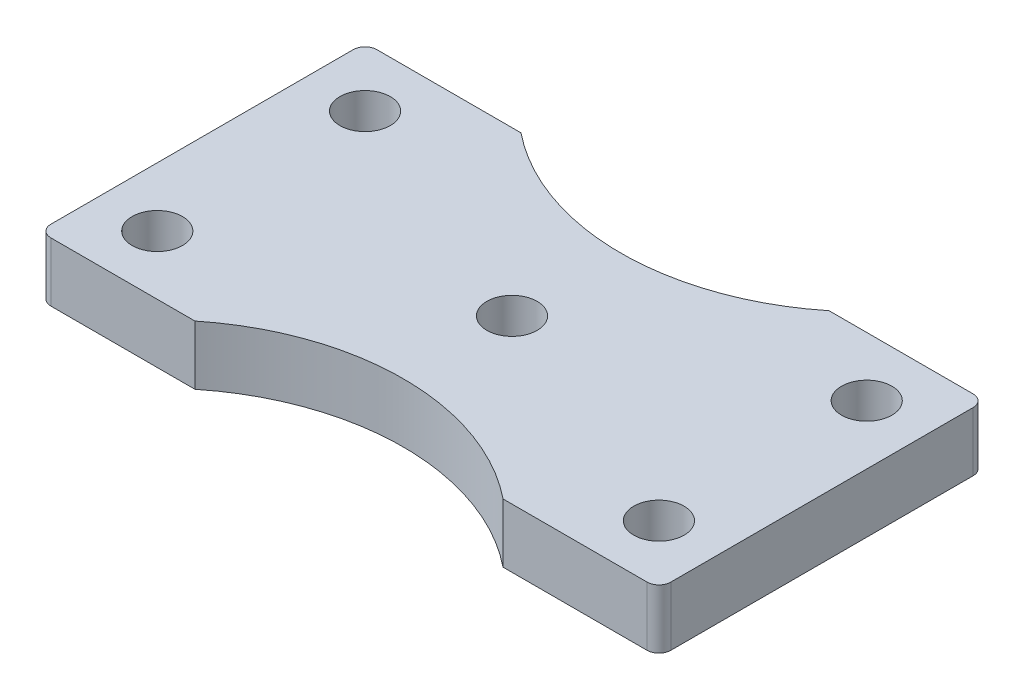
ISO-10303-21;
HEADER;
FILE_DESCRIPTION(('STEP AP214'),'2;1');
FILE_NAME('part.step','',(''),(''),'','','');
FILE_SCHEMA(('AUTOMOTIVE_DESIGN { 1 0 10303 214 1 1 1 1 }'));
ENDSEC;
DATA;
#1=APPLICATION_CONTEXT('core data for automotive mechanical design processes');
#2=APPLICATION_PROTOCOL_DEFINITION('international standard','automotive_design',2000,#1);
#3=PRODUCT_CONTEXT('',#1,'mechanical');
#4=PRODUCT('Part','Part','',(#3));
#5=PRODUCT_RELATED_PRODUCT_CATEGORY('part','',(#4));
#6=PRODUCT_DEFINITION_FORMATION('','',#4);
#7=PRODUCT_DEFINITION_CONTEXT('part definition',#1,'design');
#8=PRODUCT_DEFINITION('design','',#6,#7);
#9=PRODUCT_DEFINITION_SHAPE('','',#8);
#10=(LENGTH_UNIT() NAMED_UNIT(*) SI_UNIT(.MILLI.,.METRE.));
#11=(NAMED_UNIT(*) PLANE_ANGLE_UNIT() SI_UNIT($,.RADIAN.));
#12=(NAMED_UNIT(*) SI_UNIT($,.STERADIAN.) SOLID_ANGLE_UNIT());
#13=UNCERTAINTY_MEASURE_WITH_UNIT(LENGTH_MEASURE(1.E-05),#10,'distance_accuracy_value','');
#14=(GEOMETRIC_REPRESENTATION_CONTEXT(3) GLOBAL_UNCERTAINTY_ASSIGNED_CONTEXT((#13)) GLOBAL_UNIT_ASSIGNED_CONTEXT((#10,
#11,#12)) REPRESENTATION_CONTEXT('',''));
#15=CARTESIAN_POINT('',(0.,0.,0.));
#16=DIRECTION('',(0.,0.,1.));
#17=DIRECTION('',(1.,0.,0.));
#18=AXIS2_PLACEMENT_3D('',#15,#16,#17);
#19=CARTESIAN_POINT('',(16.01089,3.175,-8.11911));
#20=DIRECTION('',(0.,-1.,0.));
#21=DIRECTION('',(0.,0.,-1.));
#22=AXIS2_PLACEMENT_3D('',#19,#20,#21);
#23=CYLINDRICAL_SURFACE('',#22,0.635);
#24=CARTESIAN_POINT('',(16.01089,0.,-8.11911));
#25=DIRECTION('',(0.,-1.,0.));
#26=DIRECTION('',(0.,0.,-1.));
#27=AXIS2_PLACEMENT_3D('',#24,#25,#26);
#28=CIRCLE('',#27,0.635);
#29=CARTESIAN_POINT('',(16.01089,0.,-8.75411));
#30=VERTEX_POINT('',#29);
#31=CARTESIAN_POINT('',(16.64589,0.,-8.11911));
#32=VERTEX_POINT('',#31);
#33=EDGE_CURVE('E119',#30,#32,#28,.T.);
#34=ORIENTED_EDGE('',*,*,#33,.F.);
#35=DIRECTION('',(0.,1.,0.));
#36=VECTOR('',#35,1.);
#37=CARTESIAN_POINT('',(16.01089,3.175,-8.75411));
#38=LINE('',#37,#36);
#39=CARTESIAN_POINT('',(16.01089,3.175,-8.75411));
#40=VERTEX_POINT('',#39);
#41=EDGE_CURVE('E163',#30,#40,#38,.T.);
#42=ORIENTED_EDGE('',*,*,#41,.T.);
#43=CARTESIAN_POINT('',(16.01089,3.175,-8.11911));
#44=DIRECTION('',(0.,-1.,0.));
#45=DIRECTION('',(0.,0.,-1.));
#46=AXIS2_PLACEMENT_3D('',#43,#44,#45);
#47=CIRCLE('',#46,0.635);
#48=CARTESIAN_POINT('',(16.64589,3.175,-8.11911));
#49=VERTEX_POINT('',#48);
#50=EDGE_CURVE('E20',#40,#49,#47,.T.);
#51=ORIENTED_EDGE('',*,*,#50,.T.);
#52=DIRECTION('',(0.,1.,0.));
#53=VECTOR('',#52,1.);
#54=CARTESIAN_POINT('',(16.64589,3.175,-8.11911));
#55=LINE('',#54,#53);
#56=EDGE_CURVE('E157',#49,#32,#55,.F.);
#57=ORIENTED_EDGE('',*,*,#56,.T.);
#58=EDGE_LOOP('',(#34,#42,#51,#57));
#59=FACE_BOUND('',#58,.T.);
#60=ADVANCED_FACE('F17',(#59),#23,.T.);
#61=CARTESIAN_POINT('',(16.01089,3.175,8.11911));
#62=DIRECTION('',(0.,-1.,0.));
#63=DIRECTION('',(0.,0.,-1.));
#64=AXIS2_PLACEMENT_3D('',#61,#62,#63);
#65=CYLINDRICAL_SURFACE('',#64,0.635);
#66=CARTESIAN_POINT('',(16.01089,0.,8.11911));
#67=DIRECTION('',(0.,-1.,0.));
#68=DIRECTION('',(0.,0.,-1.));
#69=AXIS2_PLACEMENT_3D('',#66,#67,#68);
#70=CIRCLE('',#69,0.635);
#71=CARTESIAN_POINT('',(16.64589,0.,8.11911));
#72=VERTEX_POINT('',#71);
#73=CARTESIAN_POINT('',(16.01089,0.,8.75411));
#74=VERTEX_POINT('',#73);
#75=EDGE_CURVE('E215',#72,#74,#70,.T.);
#76=ORIENTED_EDGE('',*,*,#75,.F.);
#77=DIRECTION('',(0.,1.,0.));
#78=VECTOR('',#77,1.);
#79=CARTESIAN_POINT('',(16.64589,3.175,8.11911));
#80=LINE('',#79,#78);
#81=CARTESIAN_POINT('',(16.64589,3.175,8.11911));
#82=VERTEX_POINT('',#81);
#83=EDGE_CURVE('E160',#72,#82,#80,.T.);
#84=ORIENTED_EDGE('',*,*,#83,.T.);
#85=CARTESIAN_POINT('',(16.01089,3.175,8.11911));
#86=DIRECTION('',(0.,-1.,0.));
#87=DIRECTION('',(0.,0.,-1.));
#88=AXIS2_PLACEMENT_3D('',#85,#86,#87);
#89=CIRCLE('',#88,0.635);
#90=CARTESIAN_POINT('',(16.01089,3.175,8.75411));
#91=VERTEX_POINT('',#90);
#92=EDGE_CURVE('E220',#82,#91,#89,.T.);
#93=ORIENTED_EDGE('',*,*,#92,.T.);
#94=DIRECTION('',(0.,1.,0.));
#95=VECTOR('',#94,1.);
#96=CARTESIAN_POINT('',(16.01089,3.175,8.75411));
#97=LINE('',#96,#95);
#98=EDGE_CURVE('E153',#91,#74,#97,.F.);
#99=ORIENTED_EDGE('',*,*,#98,.T.);
#100=EDGE_LOOP('',(#76,#84,#93,#99));
#101=FACE_BOUND('',#100,.T.);
#102=ADVANCED_FACE('F290',(#101),#65,.T.);
#103=CARTESIAN_POINT('',(-16.01089,3.175,8.11911));
#104=DIRECTION('',(0.,-1.,0.));
#105=DIRECTION('',(0.,0.,-1.));
#106=AXIS2_PLACEMENT_3D('',#103,#104,#105);
#107=CYLINDRICAL_SURFACE('',#106,0.635);
#108=CARTESIAN_POINT('',(-16.01089,0.,8.11911));
#109=DIRECTION('',(0.,-1.,0.));
#110=DIRECTION('',(0.,0.,-1.));
#111=AXIS2_PLACEMENT_3D('',#108,#109,#110);
#112=CIRCLE('',#111,0.635);
#113=CARTESIAN_POINT('',(-16.01089,0.,8.75411));
#114=VERTEX_POINT('',#113);
#115=CARTESIAN_POINT('',(-16.64589,0.,8.11911));
#116=VERTEX_POINT('',#115);
#117=EDGE_CURVE('E213',#114,#116,#112,.T.);
#118=ORIENTED_EDGE('',*,*,#117,.F.);
#119=DIRECTION('',(0.,1.,0.));
#120=VECTOR('',#119,1.);
#121=CARTESIAN_POINT('',(-16.01089,3.175,8.75411));
#122=LINE('',#121,#120);
#123=CARTESIAN_POINT('',(-16.01089,3.175,8.75411));
#124=VERTEX_POINT('',#123);
#125=EDGE_CURVE('E140',#114,#124,#122,.T.);
#126=ORIENTED_EDGE('',*,*,#125,.T.);
#127=CARTESIAN_POINT('',(-16.01089,3.175,8.11911));
#128=DIRECTION('',(0.,-1.,0.));
#129=DIRECTION('',(0.,0.,-1.));
#130=AXIS2_PLACEMENT_3D('',#127,#128,#129);
#131=CIRCLE('',#130,0.635);
#132=CARTESIAN_POINT('',(-16.64589,3.175,8.11911));
#133=VERTEX_POINT('',#132);
#134=EDGE_CURVE('E219',#124,#133,#131,.T.);
#135=ORIENTED_EDGE('',*,*,#134,.T.);
#136=DIRECTION('',(0.,1.,0.));
#137=VECTOR('',#136,1.);
#138=CARTESIAN_POINT('',(-16.64589,3.175,8.11911));
#139=LINE('',#138,#137);
#140=EDGE_CURVE('E137',#133,#116,#139,.F.);
#141=ORIENTED_EDGE('',*,*,#140,.T.);
#142=EDGE_LOOP('',(#118,#126,#135,#141));
#143=FACE_BOUND('',#142,.T.);
#144=ADVANCED_FACE('F292',(#143),#107,.T.);
#145=CARTESIAN_POINT('',(-16.01089,3.175,-8.11911));
#146=DIRECTION('',(0.,-1.,0.));
#147=DIRECTION('',(0.,0.,-1.));
#148=AXIS2_PLACEMENT_3D('',#145,#146,#147);
#149=CYLINDRICAL_SURFACE('',#148,0.635);
#150=CARTESIAN_POINT('',(-16.01089,0.,-8.11911));
#151=DIRECTION('',(0.,-1.,0.));
#152=DIRECTION('',(0.,0.,-1.));
#153=AXIS2_PLACEMENT_3D('',#150,#151,#152);
#154=CIRCLE('',#153,0.635);
#155=CARTESIAN_POINT('',(-16.64589,0.,-8.11911));
#156=VERTEX_POINT('',#155);
#157=CARTESIAN_POINT('',(-16.01089,0.,-8.75411));
#158=VERTEX_POINT('',#157);
#159=EDGE_CURVE('E111',#156,#158,#154,.T.);
#160=ORIENTED_EDGE('',*,*,#159,.F.);
#161=DIRECTION('',(0.,1.,0.));
#162=VECTOR('',#161,1.);
#163=CARTESIAN_POINT('',(-16.64589,3.175,-8.11911));
#164=LINE('',#163,#162);
#165=CARTESIAN_POINT('',(-16.64589,3.175,-8.11911));
#166=VERTEX_POINT('',#165);
#167=EDGE_CURVE('E131',#156,#166,#164,.T.);
#168=ORIENTED_EDGE('',*,*,#167,.T.);
#169=CARTESIAN_POINT('',(-16.01089,3.175,-8.11911));
#170=DIRECTION('',(0.,-1.,0.));
#171=DIRECTION('',(0.,0.,-1.));
#172=AXIS2_PLACEMENT_3D('',#169,#170,#171);
#173=CIRCLE('',#172,0.635);
#174=CARTESIAN_POINT('',(-16.01089,3.175,-8.75411));
#175=VERTEX_POINT('',#174);
#176=EDGE_CURVE('E35',#166,#175,#173,.T.);
#177=ORIENTED_EDGE('',*,*,#176,.T.);
#178=DIRECTION('',(0.,1.,0.));
#179=VECTOR('',#178,1.);
#180=CARTESIAN_POINT('',(-16.01089,3.175,-8.75411));
#181=LINE('',#180,#179);
#182=EDGE_CURVE('E124',#175,#158,#181,.F.);
#183=ORIENTED_EDGE('',*,*,#182,.T.);
#184=EDGE_LOOP('',(#160,#168,#177,#183));
#185=FACE_BOUND('',#184,.T.);
#186=ADVANCED_FACE('F129',(#185),#149,.T.);
#187=CARTESIAN_POINT('',(0.,0.,0.));
#188=DIRECTION('',(0.,-1.,0.));
#189=DIRECTION('',(0.,0.,-1.));
#190=AXIS2_PLACEMENT_3D('',#187,#188,#189);
#191=PLANE('',#190);
#192=CARTESIAN_POINT('',(-13.4703841816038,0.,-5.5796158183963));
#193=DIRECTION('',(0.,1.,0.));
#194=DIRECTION('',(0.,0.,1.));
#195=AXIS2_PLACEMENT_3D('',#192,#193,#194);
#196=CIRCLE('',#195,1.35254999999999);
#197=CARTESIAN_POINT('',(-13.4703841816038,0.,-4.2270658183963));
#198=VERTEX_POINT('',#197);
#199=EDGE_CURVE('E210',#198,#198,#196,.T.);
#200=ORIENTED_EDGE('',*,*,#199,.T.);
#201=EDGE_LOOP('',(#200));
#202=FACE_BOUND('',#201,.T.);
#203=CARTESIAN_POINT('',(-13.4703841816038,0.,5.5796158183963));
#204=DIRECTION('',(0.,1.,0.));
#205=DIRECTION('',(0.,0.,1.));
#206=AXIS2_PLACEMENT_3D('',#203,#204,#205);
#207=CIRCLE('',#206,1.35254999999999);
#208=CARTESIAN_POINT('',(-13.4703841816038,0.,6.93216581839629));
#209=VERTEX_POINT('',#208);
#210=EDGE_CURVE('E207',#209,#209,#207,.T.);
#211=ORIENTED_EDGE('',*,*,#210,.T.);
#212=EDGE_LOOP('',(#211));
#213=FACE_BOUND('',#212,.T.);
#214=CARTESIAN_POINT('',(0.,0.,0.));
#215=DIRECTION('',(0.,1.,0.));
#216=DIRECTION('',(0.,0.,1.));
#217=AXIS2_PLACEMENT_3D('',#214,#215,#216);
#218=CIRCLE('',#217,1.35254999999999);
#219=CARTESIAN_POINT('',(0.,0.,1.35254999999999));
#220=VERTEX_POINT('',#219);
#221=EDGE_CURVE('E204',#220,#220,#218,.T.);
#222=ORIENTED_EDGE('',*,*,#221,.T.);
#223=EDGE_LOOP('',(#222));
#224=FACE_BOUND('',#223,.T.);
#225=CARTESIAN_POINT('',(13.4703841816038,0.,-5.5796158183963));
#226=DIRECTION('',(0.,1.,0.));
#227=DIRECTION('',(0.,0.,1.));
#228=AXIS2_PLACEMENT_3D('',#225,#226,#227);
#229=CIRCLE('',#228,1.35254999999999);
#230=CARTESIAN_POINT('',(13.4703841816038,0.,-4.2270658183963));
#231=VERTEX_POINT('',#230);
#232=EDGE_CURVE('E201',#231,#231,#229,.T.);
#233=ORIENTED_EDGE('',*,*,#232,.T.);
#234=EDGE_LOOP('',(#233));
#235=FACE_BOUND('',#234,.T.);
#236=CARTESIAN_POINT('',(13.4703841816038,0.,5.5796158183963));
#237=DIRECTION('',(0.,1.,0.));
#238=DIRECTION('',(0.,0.,1.));
#239=AXIS2_PLACEMENT_3D('',#236,#237,#238);
#240=CIRCLE('',#239,1.35254999999999);
#241=CARTESIAN_POINT('',(13.4703841816038,0.,6.93216581839629));
#242=VERTEX_POINT('',#241);
#243=EDGE_CURVE('E198',#242,#242,#240,.T.);
#244=ORIENTED_EDGE('',*,*,#243,.T.);
#245=EDGE_LOOP('',(#244));
#246=FACE_BOUND('',#245,.T.);
#247=DIRECTION('',(-1.,0.,0.));
#248=VECTOR('',#247,1.);
#249=CARTESIAN_POINT('',(-16.64589,0.,8.75411));
#250=LINE('',#249,#248);
#251=CARTESIAN_POINT('',(-8.27404999999808,0.,8.75411));
#252=VERTEX_POINT('',#251);
#253=EDGE_CURVE('E145',#252,#114,#250,.T.);
#254=ORIENTED_EDGE('',*,*,#253,.T.);
#255=ORIENTED_EDGE('',*,*,#117,.T.);
#256=DIRECTION('',(0.,0.,-1.));
#257=VECTOR('',#256,1.);
#258=CARTESIAN_POINT('',(-16.64589,0.,8.75411));
#259=LINE('',#258,#257);
#260=EDGE_CURVE('E117',#116,#156,#259,.T.);
#261=ORIENTED_EDGE('',*,*,#260,.T.);
#262=ORIENTED_EDGE('',*,*,#159,.T.);
#263=DIRECTION('',(1.,0.,0.));
#264=VECTOR('',#263,1.);
#265=CARTESIAN_POINT('',(-16.64589,0.,-8.75411));
#266=LINE('',#265,#264);
#267=CARTESIAN_POINT('',(-8.27404999999808,0.,-8.75411));
#268=VERTEX_POINT('',#267);
#269=EDGE_CURVE('E115',#158,#268,#266,.T.);
#270=ORIENTED_EDGE('',*,*,#269,.T.);
#271=CARTESIAN_POINT('',(0.,0.,-19.0493205659622));
#272=DIRECTION('',(0.,1.,0.));
#273=DIRECTION('',(0.,0.,1.));
#274=AXIS2_PLACEMENT_3D('',#271,#272,#273);
#275=CIRCLE('',#274,13.2079999999976);
#276=CARTESIAN_POINT('',(8.27404999999808,0.,-8.75411));
#277=VERTEX_POINT('',#276);
#278=EDGE_CURVE('E167',#268,#277,#275,.T.);
#279=ORIENTED_EDGE('',*,*,#278,.T.);
#280=DIRECTION('',(1.,0.,0.));
#281=VECTOR('',#280,1.);
#282=CARTESIAN_POINT('',(-16.64589,0.,-8.75411));
#283=LINE('',#282,#281);
#284=EDGE_CURVE('E166',#277,#30,#283,.T.);
#285=ORIENTED_EDGE('',*,*,#284,.T.);
#286=ORIENTED_EDGE('',*,*,#33,.T.);
#287=DIRECTION('',(0.,0.,1.));
#288=VECTOR('',#287,1.);
#289=CARTESIAN_POINT('',(16.64589,0.,8.75411));
#290=LINE('',#289,#288);
#291=EDGE_CURVE('E156',#32,#72,#290,.T.);
#292=ORIENTED_EDGE('',*,*,#291,.T.);
#293=ORIENTED_EDGE('',*,*,#75,.T.);
#294=DIRECTION('',(-1.,0.,0.));
#295=VECTOR('',#294,1.);
#296=CARTESIAN_POINT('',(-16.64589,0.,8.75411));
#297=LINE('',#296,#295);
#298=CARTESIAN_POINT('',(8.27404999999733,0.,8.75411000000094));
#299=VERTEX_POINT('',#298);
#300=EDGE_CURVE('E152',#74,#299,#297,.T.);
#301=ORIENTED_EDGE('',*,*,#300,.T.);
#302=CARTESIAN_POINT('',(0.,0.,19.0493205659622));
#303=DIRECTION('',(0.,1.,0.));
#304=DIRECTION('',(0.,0.,1.));
#305=AXIS2_PLACEMENT_3D('',#302,#303,#304);
#306=CIRCLE('',#305,13.2079999999976);
#307=EDGE_CURVE('E146',#299,#252,#306,.T.);
#308=ORIENTED_EDGE('',*,*,#307,.T.);
#309=EDGE_LOOP('',(#254,#255,#261,#262,#270,#279,#285,#286,#292,#293,#301,#308));
#310=FACE_BOUND('',#309,.T.);
#311=ADVANCED_FACE('F114',(#202,#213,#224,#235,#246,#310),#191,.T.);
#312=CARTESIAN_POINT('',(-13.4703841816038,3.175,-5.5796158183963));
#313=DIRECTION('',(0.,1.,0.));
#314=DIRECTION('',(0.,0.,1.));
#315=AXIS2_PLACEMENT_3D('',#312,#313,#314);
#316=CYLINDRICAL_SURFACE('',#315,1.35254999999999);
#317=ORIENTED_EDGE('',*,*,#199,.F.);
#318=EDGE_LOOP('',(#317));
#319=FACE_BOUND('',#318,.T.);
#320=CARTESIAN_POINT('',(-13.4703841816038,3.175,-5.5796158183963));
#321=DIRECTION('',(0.,1.,0.));
#322=DIRECTION('',(0.,0.,1.));
#323=AXIS2_PLACEMENT_3D('',#320,#321,#322);
#324=CIRCLE('',#323,1.35254999999999);
#325=CARTESIAN_POINT('',(-13.4703841816038,3.175,-4.2270658183963));
#326=VERTEX_POINT('',#325);
#327=EDGE_CURVE('E127',#326,#326,#324,.T.);
#328=ORIENTED_EDGE('',*,*,#327,.T.);
#329=EDGE_LOOP('',(#328));
#330=FACE_BOUND('',#329,.T.);
#331=ADVANCED_FACE('F304',(#319,#330),#316,.F.);
#332=CARTESIAN_POINT('',(-13.4703841816038,3.175,5.5796158183963));
#333=DIRECTION('',(0.,1.,0.));
#334=DIRECTION('',(0.,0.,1.));
#335=AXIS2_PLACEMENT_3D('',#332,#333,#334);
#336=CYLINDRICAL_SURFACE('',#335,1.35254999999999);
#337=ORIENTED_EDGE('',*,*,#210,.F.);
#338=EDGE_LOOP('',(#337));
#339=FACE_BOUND('',#338,.T.);
#340=CARTESIAN_POINT('',(-13.4703841816038,3.175,5.5796158183963));
#341=DIRECTION('',(0.,1.,0.));
#342=DIRECTION('',(0.,0.,1.));
#343=AXIS2_PLACEMENT_3D('',#340,#341,#342);
#344=CIRCLE('',#343,1.35254999999999);
#345=CARTESIAN_POINT('',(-13.4703841816038,3.175,6.93216581839629));
#346=VERTEX_POINT('',#345);
#347=EDGE_CURVE('E191',#346,#346,#344,.T.);
#348=ORIENTED_EDGE('',*,*,#347,.T.);
#349=EDGE_LOOP('',(#348));
#350=FACE_BOUND('',#349,.T.);
#351=ADVANCED_FACE('F308',(#339,#350),#336,.F.);
#352=CARTESIAN_POINT('',(0.,3.175,0.));
#353=DIRECTION('',(0.,1.,0.));
#354=DIRECTION('',(0.,0.,1.));
#355=AXIS2_PLACEMENT_3D('',#352,#353,#354);
#356=CYLINDRICAL_SURFACE('',#355,1.35254999999999);
#357=ORIENTED_EDGE('',*,*,#221,.F.);
#358=EDGE_LOOP('',(#357));
#359=FACE_BOUND('',#358,.T.);
#360=CARTESIAN_POINT('',(0.,3.175,0.));
#361=DIRECTION('',(0.,1.,0.));
#362=DIRECTION('',(0.,0.,1.));
#363=AXIS2_PLACEMENT_3D('',#360,#361,#362);
#364=CIRCLE('',#363,1.35254999999999);
#365=CARTESIAN_POINT('',(0.,3.175,1.35254999999999));
#366=VERTEX_POINT('',#365);
#367=EDGE_CURVE('E188',#366,#366,#364,.T.);
#368=ORIENTED_EDGE('',*,*,#367,.T.);
#369=EDGE_LOOP('',(#368));
#370=FACE_BOUND('',#369,.T.);
#371=ADVANCED_FACE('F312',(#359,#370),#356,.F.);
#372=CARTESIAN_POINT('',(13.4703841816038,3.175,-5.5796158183963));
#373=DIRECTION('',(0.,1.,0.));
#374=DIRECTION('',(0.,0.,1.));
#375=AXIS2_PLACEMENT_3D('',#372,#373,#374);
#376=CYLINDRICAL_SURFACE('',#375,1.35254999999999);
#377=ORIENTED_EDGE('',*,*,#232,.F.);
#378=EDGE_LOOP('',(#377));
#379=FACE_BOUND('',#378,.T.);
#380=CARTESIAN_POINT('',(13.4703841816038,3.175,-5.5796158183963));
#381=DIRECTION('',(0.,1.,0.));
#382=DIRECTION('',(0.,0.,1.));
#383=AXIS2_PLACEMENT_3D('',#380,#381,#382);
#384=CIRCLE('',#383,1.35254999999999);
#385=CARTESIAN_POINT('',(13.4703841816038,3.175,-4.2270658183963));
#386=VERTEX_POINT('',#385);
#387=EDGE_CURVE('E185',#386,#386,#384,.T.);
#388=ORIENTED_EDGE('',*,*,#387,.T.);
#389=EDGE_LOOP('',(#388));
#390=FACE_BOUND('',#389,.T.);
#391=ADVANCED_FACE('F316',(#379,#390),#376,.F.);
#392=CARTESIAN_POINT('',(13.4703841816038,3.175,5.5796158183963));
#393=DIRECTION('',(0.,1.,0.));
#394=DIRECTION('',(0.,0.,1.));
#395=AXIS2_PLACEMENT_3D('',#392,#393,#394);
#396=CYLINDRICAL_SURFACE('',#395,1.35254999999999);
#397=ORIENTED_EDGE('',*,*,#243,.F.);
#398=EDGE_LOOP('',(#397));
#399=FACE_BOUND('',#398,.T.);
#400=CARTESIAN_POINT('',(13.4703841816038,3.175,5.5796158183963));
#401=DIRECTION('',(0.,1.,0.));
#402=DIRECTION('',(0.,0.,1.));
#403=AXIS2_PLACEMENT_3D('',#400,#401,#402);
#404=CIRCLE('',#403,1.35254999999999);
#405=CARTESIAN_POINT('',(13.4703841816038,3.175,6.93216581839629));
#406=VERTEX_POINT('',#405);
#407=EDGE_CURVE('E182',#406,#406,#404,.T.);
#408=ORIENTED_EDGE('',*,*,#407,.T.);
#409=EDGE_LOOP('',(#408));
#410=FACE_BOUND('',#409,.T.);
#411=ADVANCED_FACE('F259',(#399,#410),#396,.F.);
#412=CARTESIAN_POINT('',(0.,0.,-19.0493205659622));
#413=DIRECTION('',(0.,1.,0.));
#414=DIRECTION('',(0.,0.,1.));
#415=AXIS2_PLACEMENT_3D('',#412,#413,#414);
#416=CYLINDRICAL_SURFACE('',#415,13.2079999999976);
#417=ORIENTED_EDGE('',*,*,#278,.F.);
#418=DIRECTION('',(0.,1.,0.));
#419=VECTOR('',#418,1.);
#420=CARTESIAN_POINT('',(-8.27405,3.175,-8.75411));
#421=LINE('',#420,#419);
#422=CARTESIAN_POINT('',(-8.27404999999808,3.175,-8.75411));
#423=VERTEX_POINT('',#422);
#424=EDGE_CURVE('E126',#268,#423,#421,.T.);
#425=ORIENTED_EDGE('',*,*,#424,.T.);
#426=CARTESIAN_POINT('',(0.,3.175,-19.0493205659622));
#427=DIRECTION('',(0.,1.,0.));
#428=DIRECTION('',(0.,0.,1.));
#429=AXIS2_PLACEMENT_3D('',#426,#427,#428);
#430=CIRCLE('',#429,13.2079999999976);
#431=CARTESIAN_POINT('',(8.27404999999808,3.175,-8.75411));
#432=VERTEX_POINT('',#431);
#433=EDGE_CURVE('E68',#423,#432,#430,.T.);
#434=ORIENTED_EDGE('',*,*,#433,.T.);
#435=DIRECTION('',(0.,1.,0.));
#436=VECTOR('',#435,1.);
#437=CARTESIAN_POINT('',(8.27405,3.175,-8.75411));
#438=LINE('',#437,#436);
#439=EDGE_CURVE('E164',#432,#277,#438,.F.);
#440=ORIENTED_EDGE('',*,*,#439,.T.);
#441=EDGE_LOOP('',(#417,#425,#434,#440));
#442=FACE_BOUND('',#441,.T.);
#443=ADVANCED_FACE('F246',(#442),#416,.F.);
#444=CARTESIAN_POINT('',(-16.64589,3.175,-8.75411));
#445=DIRECTION('',(0.,0.,1.));
#446=DIRECTION('',(1.,0.,0.));
#447=AXIS2_PLACEMENT_3D('',#444,#445,#446);
#448=PLANE('',#447);
#449=ORIENTED_EDGE('',*,*,#41,.F.);
#450=ORIENTED_EDGE('',*,*,#284,.F.);
#451=ORIENTED_EDGE('',*,*,#439,.F.);
#452=DIRECTION('',(1.,0.,0.));
#453=VECTOR('',#452,1.);
#454=CARTESIAN_POINT('',(0.,3.175,-8.75411));
#455=LINE('',#454,#453);
#456=EDGE_CURVE('E134',#432,#40,#455,.T.);
#457=ORIENTED_EDGE('',*,*,#456,.T.);
#458=EDGE_LOOP('',(#449,#450,#451,#457));
#459=FACE_BOUND('',#458,.T.);
#460=ADVANCED_FACE('F249',(#459),#448,.F.);
#461=CARTESIAN_POINT('',(16.64589,3.175,8.75411));
#462=DIRECTION('',(-1.,0.,0.));
#463=DIRECTION('',(0.,0.,1.));
#464=AXIS2_PLACEMENT_3D('',#461,#462,#463);
#465=PLANE('',#464);
#466=ORIENTED_EDGE('',*,*,#56,.F.);
#467=DIRECTION('',(0.,0.,-1.));
#468=VECTOR('',#467,1.);
#469=CARTESIAN_POINT('',(16.64589,3.175,0.));
#470=LINE('',#469,#468);
#471=EDGE_CURVE('E231',#49,#82,#470,.F.);
#472=ORIENTED_EDGE('',*,*,#471,.T.);
#473=ORIENTED_EDGE('',*,*,#83,.F.);
#474=ORIENTED_EDGE('',*,*,#291,.F.);
#475=EDGE_LOOP('',(#466,#472,#473,#474));
#476=FACE_BOUND('',#475,.T.);
#477=ADVANCED_FACE('F230',(#476),#465,.F.);
#478=CARTESIAN_POINT('',(-16.64589,3.175,8.75411));
#479=DIRECTION('',(0.,0.,-1.));
#480=DIRECTION('',(-1.,0.,0.));
#481=AXIS2_PLACEMENT_3D('',#478,#479,#480);
#482=PLANE('',#481);
#483=ORIENTED_EDGE('',*,*,#98,.F.);
#484=DIRECTION('',(1.,0.,0.));
#485=VECTOR('',#484,1.);
#486=CARTESIAN_POINT('',(0.,3.175,8.75411));
#487=LINE('',#486,#485);
#488=CARTESIAN_POINT('',(8.27404999999733,3.175,8.75411000000094));
#489=VERTEX_POINT('',#488);
#490=EDGE_CURVE('E180',#91,#489,#487,.F.);
#491=ORIENTED_EDGE('',*,*,#490,.T.);
#492=DIRECTION('',(0.,1.,0.));
#493=VECTOR('',#492,1.);
#494=CARTESIAN_POINT('',(8.27404999999849,0.,8.75411000000188));
#495=LINE('',#494,#493);
#496=EDGE_CURVE('E149',#489,#299,#495,.F.);
#497=ORIENTED_EDGE('',*,*,#496,.T.);
#498=ORIENTED_EDGE('',*,*,#300,.F.);
#499=EDGE_LOOP('',(#483,#491,#497,#498));
#500=FACE_BOUND('',#499,.T.);
#501=ADVANCED_FACE('F257',(#500),#482,.F.);
#502=CARTESIAN_POINT('',(0.,0.,19.0493205659622));
#503=DIRECTION('',(0.,1.,0.));
#504=DIRECTION('',(0.,0.,1.));
#505=AXIS2_PLACEMENT_3D('',#502,#503,#504);
#506=CYLINDRICAL_SURFACE('',#505,13.2079999999976);
#507=DIRECTION('',(0.,1.,0.));
#508=VECTOR('',#507,1.);
#509=CARTESIAN_POINT('',(-8.27405,3.175,8.75411));
#510=LINE('',#509,#508);
#511=CARTESIAN_POINT('',(-8.27404999999808,3.175,8.75411));
#512=VERTEX_POINT('',#511);
#513=EDGE_CURVE('E142',#512,#252,#510,.F.);
#514=ORIENTED_EDGE('',*,*,#513,.T.);
#515=ORIENTED_EDGE('',*,*,#307,.F.);
#516=ORIENTED_EDGE('',*,*,#496,.F.);
#517=CARTESIAN_POINT('',(0.,3.175,19.0493205659622));
#518=DIRECTION('',(0.,1.,0.));
#519=DIRECTION('',(0.,0.,1.));
#520=AXIS2_PLACEMENT_3D('',#517,#518,#519);
#521=CIRCLE('',#520,13.2079999999976);
#522=EDGE_CURVE('E176',#489,#512,#521,.T.);
#523=ORIENTED_EDGE('',*,*,#522,.T.);
#524=EDGE_LOOP('',(#514,#515,#516,#523));
#525=FACE_BOUND('',#524,.T.);
#526=ADVANCED_FACE('F273',(#525),#506,.F.);
#527=CARTESIAN_POINT('',(-16.64589,3.175,8.75411));
#528=DIRECTION('',(0.,0.,-1.));
#529=DIRECTION('',(-1.,0.,0.));
#530=AXIS2_PLACEMENT_3D('',#527,#528,#529);
#531=PLANE('',#530);
#532=ORIENTED_EDGE('',*,*,#125,.F.);
#533=ORIENTED_EDGE('',*,*,#253,.F.);
#534=ORIENTED_EDGE('',*,*,#513,.F.);
#535=DIRECTION('',(1.,0.,0.));
#536=VECTOR('',#535,1.);
#537=CARTESIAN_POINT('',(0.,3.175,8.75411));
#538=LINE('',#537,#536);
#539=EDGE_CURVE('E179',#512,#124,#538,.F.);
#540=ORIENTED_EDGE('',*,*,#539,.T.);
#541=EDGE_LOOP('',(#532,#533,#534,#540));
#542=FACE_BOUND('',#541,.T.);
#543=ADVANCED_FACE('F270',(#542),#531,.F.);
#544=CARTESIAN_POINT('',(-16.64589,3.175,8.75411));
#545=DIRECTION('',(1.,0.,0.));
#546=DIRECTION('',(0.,0.,-1.));
#547=AXIS2_PLACEMENT_3D('',#544,#545,#546);
#548=PLANE('',#547);
#549=ORIENTED_EDGE('',*,*,#167,.F.);
#550=ORIENTED_EDGE('',*,*,#260,.F.);
#551=ORIENTED_EDGE('',*,*,#140,.F.);
#552=DIRECTION('',(0.,0.,-1.));
#553=VECTOR('',#552,1.);
#554=CARTESIAN_POINT('',(-16.64589,3.175,0.));
#555=LINE('',#554,#553);
#556=EDGE_CURVE('E26',#133,#166,#555,.T.);
#557=ORIENTED_EDGE('',*,*,#556,.T.);
#558=EDGE_LOOP('',(#549,#550,#551,#557));
#559=FACE_BOUND('',#558,.T.);
#560=ADVANCED_FACE('F244',(#559),#548,.F.);
#561=CARTESIAN_POINT('',(-16.64589,3.175,-8.75411));
#562=DIRECTION('',(0.,0.,1.));
#563=DIRECTION('',(1.,0.,0.));
#564=AXIS2_PLACEMENT_3D('',#561,#562,#563);
#565=PLANE('',#564);
#566=ORIENTED_EDGE('',*,*,#182,.F.);
#567=DIRECTION('',(1.,0.,0.));
#568=VECTOR('',#567,1.);
#569=CARTESIAN_POINT('',(0.,3.175,-8.75411));
#570=LINE('',#569,#568);
#571=EDGE_CURVE('E10',#175,#423,#570,.T.);
#572=ORIENTED_EDGE('',*,*,#571,.T.);
#573=ORIENTED_EDGE('',*,*,#424,.F.);
#574=ORIENTED_EDGE('',*,*,#269,.F.);
#575=EDGE_LOOP('',(#566,#572,#573,#574));
#576=FACE_BOUND('',#575,.T.);
#577=ADVANCED_FACE('F123',(#576),#565,.F.);
#578=CARTESIAN_POINT('',(0.,3.175,0.));
#579=DIRECTION('',(0.,-1.,0.));
#580=DIRECTION('',(0.,0.,-1.));
#581=AXIS2_PLACEMENT_3D('',#578,#579,#580);
#582=PLANE('',#581);
#583=ORIENTED_EDGE('',*,*,#176,.F.);
#584=ORIENTED_EDGE('',*,*,#556,.F.);
#585=ORIENTED_EDGE('',*,*,#134,.F.);
#586=ORIENTED_EDGE('',*,*,#539,.F.);
#587=ORIENTED_EDGE('',*,*,#522,.F.);
#588=ORIENTED_EDGE('',*,*,#490,.F.);
#589=ORIENTED_EDGE('',*,*,#92,.F.);
#590=ORIENTED_EDGE('',*,*,#471,.F.);
#591=ORIENTED_EDGE('',*,*,#50,.F.);
#592=ORIENTED_EDGE('',*,*,#456,.F.);
#593=ORIENTED_EDGE('',*,*,#433,.F.);
#594=ORIENTED_EDGE('',*,*,#571,.F.);
#595=EDGE_LOOP('',(#583,#584,#585,#586,#587,#588,#589,#590,#591,#592,#593,#594));
#596=FACE_BOUND('',#595,.T.);
#597=ORIENTED_EDGE('',*,*,#407,.F.);
#598=EDGE_LOOP('',(#597));
#599=FACE_BOUND('',#598,.T.);
#600=ORIENTED_EDGE('',*,*,#387,.F.);
#601=EDGE_LOOP('',(#600));
#602=FACE_BOUND('',#601,.T.);
#603=ORIENTED_EDGE('',*,*,#367,.F.);
#604=EDGE_LOOP('',(#603));
#605=FACE_BOUND('',#604,.T.);
#606=ORIENTED_EDGE('',*,*,#347,.F.);
#607=EDGE_LOOP('',(#606));
#608=FACE_BOUND('',#607,.T.);
#609=ORIENTED_EDGE('',*,*,#327,.F.);
#610=EDGE_LOOP('',(#609));
#611=FACE_BOUND('',#610,.T.);
#612=ADVANCED_FACE('F232',(#596,#599,#602,#605,#608,#611),#582,.F.);
#613=CLOSED_SHELL('',(#60,#102,#144,#186,#311,#331,#351,#371,#391,#411,#443,#460,#477,#501,#526,
#543,#560,#577,#612));
#614=MANIFOLD_SOLID_BREP('B1',#613);
#615=ADVANCED_BREP_SHAPE_REPRESENTATION('',(#18,#614),#14);
#616=SHAPE_DEFINITION_REPRESENTATION(#9,#615);
ENDSEC;
END-ISO-10303-21;
